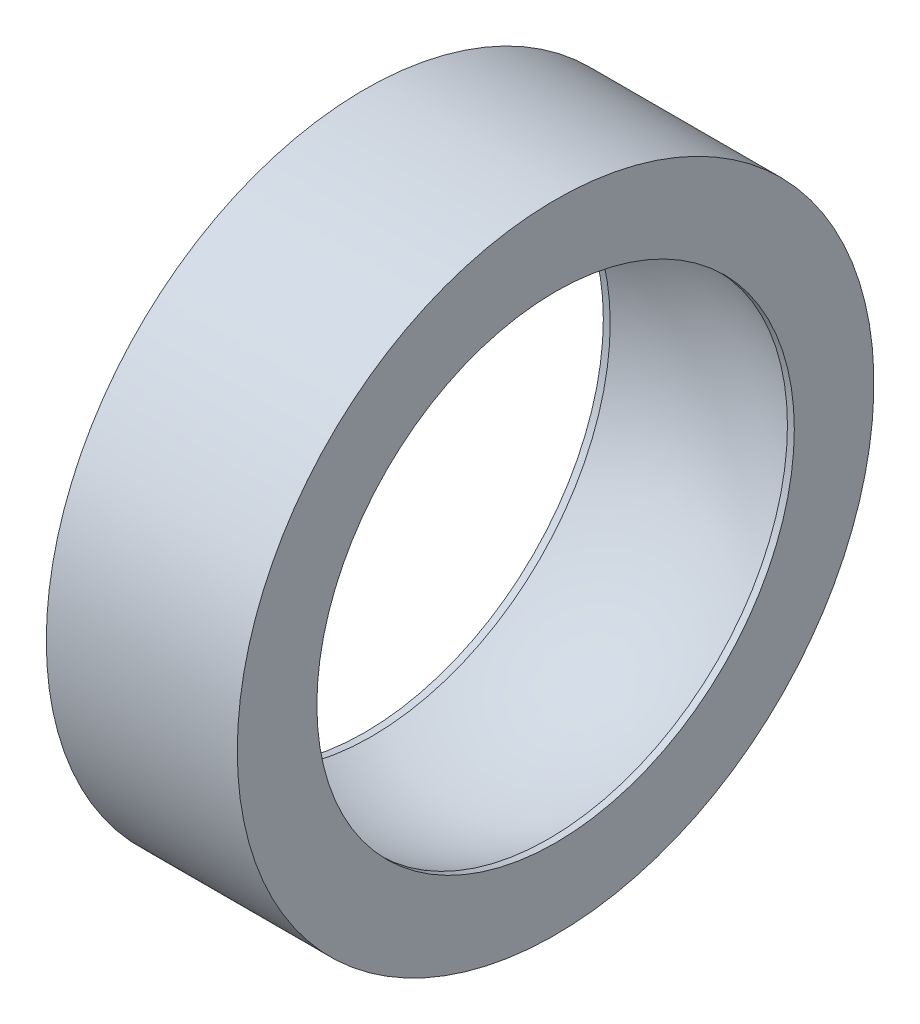
ISO-10303-21;
HEADER;
FILE_DESCRIPTION(('STEP AP214'),'2;1');
FILE_NAME('part.step','',(''),(''),'','','');
FILE_SCHEMA(('AUTOMOTIVE_DESIGN { 1 0 10303 214 1 1 1 1 }'));
ENDSEC;
DATA;
#1=APPLICATION_CONTEXT('core data for automotive mechanical design processes');
#2=APPLICATION_PROTOCOL_DEFINITION('international standard','automotive_design',2000,#1);
#3=PRODUCT_CONTEXT('',#1,'mechanical');
#4=PRODUCT('Part','Part','',(#3));
#5=PRODUCT_RELATED_PRODUCT_CATEGORY('part','',(#4));
#6=PRODUCT_DEFINITION_FORMATION('','',#4);
#7=PRODUCT_DEFINITION_CONTEXT('part definition',#1,'design');
#8=PRODUCT_DEFINITION('design','',#6,#7);
#9=PRODUCT_DEFINITION_SHAPE('','',#8);
#10=(LENGTH_UNIT() NAMED_UNIT(*) SI_UNIT(.MILLI.,.METRE.));
#11=(NAMED_UNIT(*) PLANE_ANGLE_UNIT() SI_UNIT($,.RADIAN.));
#12=(NAMED_UNIT(*) SI_UNIT($,.STERADIAN.) SOLID_ANGLE_UNIT());
#13=UNCERTAINTY_MEASURE_WITH_UNIT(LENGTH_MEASURE(1.E-05),#10,'distance_accuracy_value','');
#14=(GEOMETRIC_REPRESENTATION_CONTEXT(3) GLOBAL_UNCERTAINTY_ASSIGNED_CONTEXT((#13)) GLOBAL_UNIT_ASSIGNED_CONTEXT((#10,
#11,#12)) REPRESENTATION_CONTEXT('',''));
#15=CARTESIAN_POINT('',(0.,0.,0.));
#16=DIRECTION('',(0.,0.,1.));
#17=DIRECTION('',(1.,0.,0.));
#18=AXIS2_PLACEMENT_3D('',#15,#16,#17);
#19=CARTESIAN_POINT('',(-10.16,0.,0.));
#20=DIRECTION('',(-1.,0.,0.));
#21=DIRECTION('',(0.,0.,1.));
#22=AXIS2_PLACEMENT_3D('',#19,#20,#21);
#23=CYLINDRICAL_SURFACE('',#22,7.62);
#24=CARTESIAN_POINT('',(-2.82842429631765,0.,0.));
#25=DIRECTION('',(-1.,0.,0.));
#26=DIRECTION('',(0.,0.,1.));
#27=AXIS2_PLACEMENT_3D('',#24,#25,#26);
#28=CIRCLE('',#27,7.62);
#29=CARTESIAN_POINT('',(-2.82842429631765,0.,7.62));
#30=VERTEX_POINT('',#29);
#31=EDGE_CURVE('E10',#30,#30,#28,.T.);
#32=ORIENTED_EDGE('',*,*,#31,.F.);
#33=EDGE_LOOP('',(#32));
#34=FACE_BOUND('',#33,.T.);
#35=CARTESIAN_POINT('',(-3.048,0.,0.));
#36=DIRECTION('',(-1.,0.,0.));
#37=DIRECTION('',(0.,0.,1.));
#38=AXIS2_PLACEMENT_3D('',#35,#36,#37);
#39=CIRCLE('',#38,7.62);
#40=CARTESIAN_POINT('',(-3.048,0.,7.62));
#41=VERTEX_POINT('',#40);
#42=EDGE_CURVE('E56',#41,#41,#39,.T.);
#43=ORIENTED_EDGE('',*,*,#42,.T.);
#44=EDGE_LOOP('',(#43));
#45=FACE_BOUND('',#44,.T.);
#46=ADVANCED_FACE('F34',(#34,#45),#23,.F.);
#47=CARTESIAN_POINT('',(0.,0.,0.));
#48=DIRECTION('',(-1.,0.,0.));
#49=DIRECTION('',(0.,1.,0.));
#50=AXIS2_PLACEMENT_3D('',#47,#48,#49);
#51=SPHERICAL_SURFACE('',#50,8.128);
#52=CARTESIAN_POINT('',(2.82842429631765,0.,0.));
#53=DIRECTION('',(-1.,0.,0.));
#54=DIRECTION('',(0.,0.,1.));
#55=AXIS2_PLACEMENT_3D('',#52,#53,#54);
#56=CIRCLE('',#55,7.62);
#57=CARTESIAN_POINT('',(2.82842429631765,0.,7.62));
#58=VERTEX_POINT('',#57);
#59=EDGE_CURVE('E40',#58,#58,#56,.T.);
#60=ORIENTED_EDGE('',*,*,#59,.F.);
#61=EDGE_LOOP('',(#60));
#62=FACE_BOUND('',#61,.T.);
#63=ORIENTED_EDGE('',*,*,#31,.T.);
#64=EDGE_LOOP('',(#63));
#65=FACE_BOUND('',#64,.T.);
#66=ADVANCED_FACE('F81',(#62,#65),#51,.F.);
#67=CARTESIAN_POINT('',(-10.16,0.,0.));
#68=DIRECTION('',(-1.,0.,0.));
#69=DIRECTION('',(0.,0.,1.));
#70=AXIS2_PLACEMENT_3D('',#67,#68,#69);
#71=CYLINDRICAL_SURFACE('',#70,7.62);
#72=CARTESIAN_POINT('',(3.048,0.,0.));
#73=DIRECTION('',(-1.,0.,0.));
#74=DIRECTION('',(0.,0.,1.));
#75=AXIS2_PLACEMENT_3D('',#72,#73,#74);
#76=CIRCLE('',#75,7.62);
#77=CARTESIAN_POINT('',(3.048,0.,7.62));
#78=VERTEX_POINT('',#77);
#79=EDGE_CURVE('E44',#78,#78,#76,.T.);
#80=ORIENTED_EDGE('',*,*,#79,.F.);
#81=EDGE_LOOP('',(#80));
#82=FACE_BOUND('',#81,.T.);
#83=ORIENTED_EDGE('',*,*,#59,.T.);
#84=EDGE_LOOP('',(#83));
#85=FACE_BOUND('',#84,.T.);
#86=ADVANCED_FACE('F75',(#82,#85),#71,.F.);
#87=CARTESIAN_POINT('',(3.048,0.,0.));
#88=DIRECTION('',(1.,0.,0.));
#89=DIRECTION('',(0.,0.,-1.));
#90=AXIS2_PLACEMENT_3D('',#87,#88,#89);
#91=PLANE('',#90);
#92=ORIENTED_EDGE('',*,*,#79,.T.);
#93=EDGE_LOOP('',(#92));
#94=FACE_BOUND('',#93,.T.);
#95=CARTESIAN_POINT('',(3.048,0.,0.));
#96=DIRECTION('',(-1.,0.,0.));
#97=DIRECTION('',(0.,0.,1.));
#98=AXIS2_PLACEMENT_3D('',#95,#96,#97);
#99=CIRCLE('',#98,10.16);
#100=CARTESIAN_POINT('',(3.048,0.,10.16));
#101=VERTEX_POINT('',#100);
#102=EDGE_CURVE('E48',#101,#101,#99,.T.);
#103=ORIENTED_EDGE('',*,*,#102,.F.);
#104=EDGE_LOOP('',(#103));
#105=FACE_BOUND('',#104,.T.);
#106=ADVANCED_FACE('F70',(#94,#105),#91,.T.);
#107=CARTESIAN_POINT('',(-10.16,0.,0.));
#108=DIRECTION('',(-1.,0.,0.));
#109=DIRECTION('',(0.,0.,1.));
#110=AXIS2_PLACEMENT_3D('',#107,#108,#109);
#111=CYLINDRICAL_SURFACE('',#110,10.16);
#112=CARTESIAN_POINT('',(-3.048,0.,0.));
#113=DIRECTION('',(-1.,0.,0.));
#114=DIRECTION('',(0.,0.,1.));
#115=AXIS2_PLACEMENT_3D('',#112,#113,#114);
#116=CIRCLE('',#115,10.16);
#117=CARTESIAN_POINT('',(-3.048,0.,10.16));
#118=VERTEX_POINT('',#117);
#119=EDGE_CURVE('E53',#118,#118,#116,.T.);
#120=ORIENTED_EDGE('',*,*,#119,.F.);
#121=EDGE_LOOP('',(#120));
#122=FACE_BOUND('',#121,.T.);
#123=ORIENTED_EDGE('',*,*,#102,.T.);
#124=EDGE_LOOP('',(#123));
#125=FACE_BOUND('',#124,.T.);
#126=ADVANCED_FACE('F64',(#122,#125),#111,.T.);
#127=CARTESIAN_POINT('',(-3.048,0.,0.));
#128=DIRECTION('',(1.,0.,0.));
#129=DIRECTION('',(0.,0.,-1.));
#130=AXIS2_PLACEMENT_3D('',#127,#128,#129);
#131=PLANE('',#130);
#132=ORIENTED_EDGE('',*,*,#42,.F.);
#133=EDGE_LOOP('',(#132));
#134=FACE_BOUND('',#133,.T.);
#135=ORIENTED_EDGE('',*,*,#119,.T.);
#136=EDGE_LOOP('',(#135));
#137=FACE_BOUND('',#136,.T.);
#138=ADVANCED_FACE('F61',(#134,#137),#131,.F.);
#139=CLOSED_SHELL('',(#46,#66,#86,#106,#126,#138));
#140=MANIFOLD_SOLID_BREP('B2',#139);
#141=ADVANCED_BREP_SHAPE_REPRESENTATION('',(#18,#140),#14);
#142=SHAPE_DEFINITION_REPRESENTATION(#9,#141);
ENDSEC;
END-ISO-10303-21;
